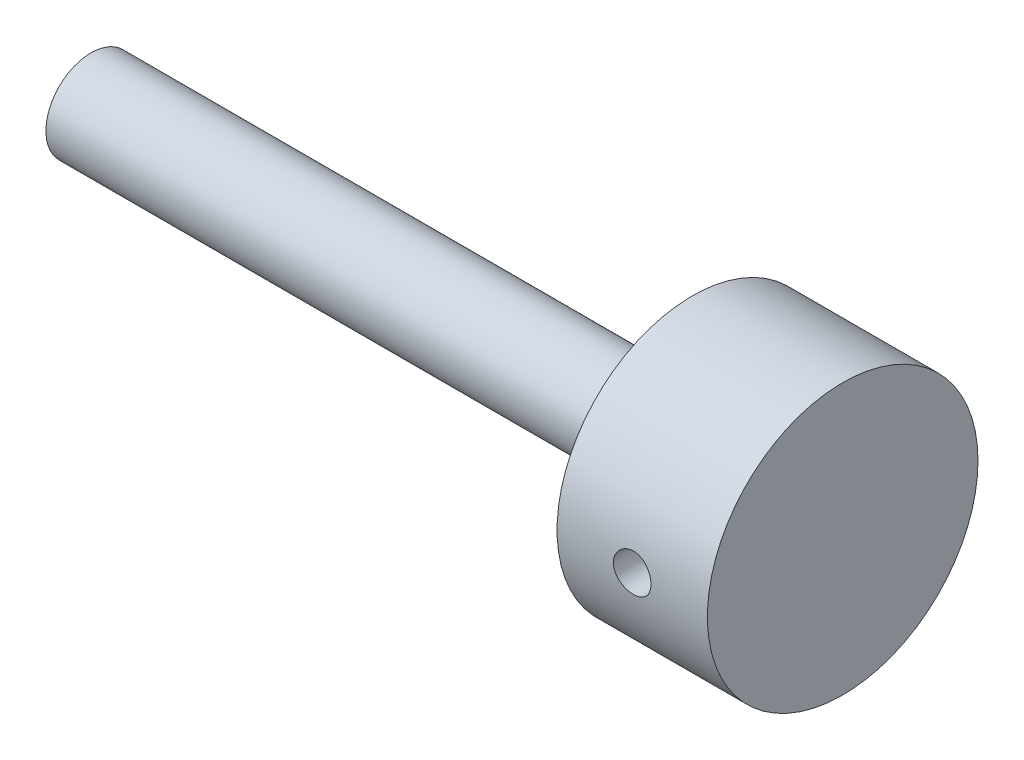
ISO-10303-21;
HEADER;
FILE_DESCRIPTION(('STEP AP214'),'2;1');
FILE_NAME('part.step','',(''),(''),'','','');
FILE_SCHEMA(('AUTOMOTIVE_DESIGN { 1 0 10303 214 1 1 1 1 }'));
ENDSEC;
DATA;
#1=APPLICATION_CONTEXT('core data for automotive mechanical design processes');
#2=APPLICATION_PROTOCOL_DEFINITION('international standard','automotive_design',2000,#1);
#3=PRODUCT_CONTEXT('',#1,'mechanical');
#4=PRODUCT('Part','Part','',(#3));
#5=PRODUCT_RELATED_PRODUCT_CATEGORY('part','',(#4));
#6=PRODUCT_DEFINITION_FORMATION('','',#4);
#7=PRODUCT_DEFINITION_CONTEXT('part definition',#1,'design');
#8=PRODUCT_DEFINITION('design','',#6,#7);
#9=PRODUCT_DEFINITION_SHAPE('','',#8);
#10=(LENGTH_UNIT() NAMED_UNIT(*) SI_UNIT(.MILLI.,.METRE.));
#11=(NAMED_UNIT(*) PLANE_ANGLE_UNIT() SI_UNIT($,.RADIAN.));
#12=(NAMED_UNIT(*) SI_UNIT($,.STERADIAN.) SOLID_ANGLE_UNIT());
#13=UNCERTAINTY_MEASURE_WITH_UNIT(LENGTH_MEASURE(1.E-05),#10,'distance_accuracy_value','');
#14=(GEOMETRIC_REPRESENTATION_CONTEXT(3) GLOBAL_UNCERTAINTY_ASSIGNED_CONTEXT((#13)) GLOBAL_UNIT_ASSIGNED_CONTEXT((#10,
#11,#12)) REPRESENTATION_CONTEXT('',''));
#15=CARTESIAN_POINT('',(0.,0.,0.));
#16=DIRECTION('',(0.,0.,1.));
#17=DIRECTION('',(1.,0.,0.));
#18=AXIS2_PLACEMENT_3D('',#15,#16,#17);
#19=CARTESIAN_POINT('',(-20.2352110000748,6.,0.));
#20=DIRECTION('',(1.,0.,0.));
#21=DIRECTION('',(0.,0.,-1.));
#22=AXIS2_PLACEMENT_3D('',#19,#20,#21);
#23=PLANE('',#22);
#24=CARTESIAN_POINT('',(-20.2352110000748,6.,0.));
#25=DIRECTION('',(1.,0.,0.));
#26=DIRECTION('',(0.,0.,-1.));
#27=AXIS2_PLACEMENT_3D('',#24,#25,#26);
#28=CIRCLE('',#27,6.);
#29=CARTESIAN_POINT('',(-20.2352110000748,6.,-6.));
#30=VERTEX_POINT('',#29);
#31=EDGE_CURVE('E10',#30,#30,#28,.T.);
#32=ORIENTED_EDGE('',*,*,#31,.F.);
#33=EDGE_LOOP('',(#32));
#34=FACE_BOUND('',#33,.T.);
#35=ADVANCED_FACE('F36',(#34),#23,.F.);
#36=CARTESIAN_POINT('',(79.7647889999252,6.,0.));
#37=DIRECTION('',(1.,0.,0.));
#38=DIRECTION('',(0.,0.,-1.));
#39=AXIS2_PLACEMENT_3D('',#36,#37,#38);
#40=CYLINDRICAL_SURFACE('',#39,6.);
#41=CARTESIAN_POINT('',(59.7647889999252,6.,0.));
#42=DIRECTION('',(1.,0.,0.));
#43=DIRECTION('',(0.,0.,-1.));
#44=AXIS2_PLACEMENT_3D('',#41,#42,#43);
#45=CIRCLE('',#44,6.);
#46=CARTESIAN_POINT('',(59.7647889999252,6.,-6.));
#47=VERTEX_POINT('',#46);
#48=EDGE_CURVE('E49',#47,#47,#45,.T.);
#49=ORIENTED_EDGE('',*,*,#48,.F.);
#50=EDGE_LOOP('',(#49));
#51=FACE_BOUND('',#50,.T.);
#52=ORIENTED_EDGE('',*,*,#31,.T.);
#53=EDGE_LOOP('',(#52));
#54=FACE_BOUND('',#53,.T.);
#55=ADVANCED_FACE('F84',(#51,#54),#40,.T.);
#56=CARTESIAN_POINT('',(59.7647889999252,0.,0.));
#57=DIRECTION('',(1.,0.,0.));
#58=DIRECTION('',(0.,0.,-1.));
#59=AXIS2_PLACEMENT_3D('',#56,#57,#58);
#60=PLANE('',#59);
#61=CARTESIAN_POINT('',(59.7647889999252,6.,0.));
#62=DIRECTION('',(1.,0.,0.));
#63=DIRECTION('',(0.,0.,-1.));
#64=AXIS2_PLACEMENT_3D('',#61,#62,#63);
#65=CIRCLE('',#64,18.);
#66=CARTESIAN_POINT('',(59.7647889999252,6.,-18.));
#67=VERTEX_POINT('',#66);
#68=EDGE_CURVE('E55',#67,#67,#65,.T.);
#69=ORIENTED_EDGE('',*,*,#68,.F.);
#70=EDGE_LOOP('',(#69));
#71=FACE_BOUND('',#70,.T.);
#72=ORIENTED_EDGE('',*,*,#48,.T.);
#73=EDGE_LOOP('',(#72));
#74=FACE_BOUND('',#73,.T.);
#75=ADVANCED_FACE('F80',(#71,#74),#60,.F.);
#76=CARTESIAN_POINT('',(79.7647889999252,6.,0.));
#77=DIRECTION('',(1.,0.,0.));
#78=DIRECTION('',(0.,0.,-1.));
#79=AXIS2_PLACEMENT_3D('',#76,#77,#78);
#80=CYLINDRICAL_SURFACE('',#79,18.);
#81=CARTESIAN_POINT('',(67.26,6.,-18.));
#82=CARTESIAN_POINT('',(67.2600058471731,5.86029511346504,-17.9999978822551));
#83=CARTESIAN_POINT('',(67.2717499855795,5.72050624717895,-17.998356438195));
#84=CARTESIAN_POINT('',(67.3184089818993,5.44482768012588,-17.991966325724));
#85=CARTESIAN_POINT('',(67.3533471632129,5.30894204800389,-17.9872145296815));
#86=CARTESIAN_POINT('',(67.4453370392228,5.04510012789121,-17.9751383249889));
#87=CARTESIAN_POINT('',(67.5023728689389,4.91713822733907,-17.9678157623709));
#88=CARTESIAN_POINT('',(67.6369020672775,4.67262362786672,-17.9514096201345));
#89=CARTESIAN_POINT('',(67.7143922847708,4.55606917534422,-17.9423263118276));
#90=CARTESIAN_POINT('',(67.8881877758561,4.33687084632937,-17.9233422162511));
#91=CARTESIAN_POINT('',(67.9846035392599,4.23431496241896,-17.9134368356955));
#92=CARTESIAN_POINT('',(68.1932756382988,4.04678353198305,-17.8939614447075));
#93=CARTESIAN_POINT('',(68.3055328344181,3.96180894106728,-17.8843914525283));
#94=CARTESIAN_POINT('',(68.5432837910686,3.81151627720471,-17.8666256039175));
#95=CARTESIAN_POINT('',(68.6688310852064,3.74628212845693,-17.8584356782365));
#96=CARTESIAN_POINT('',(68.9292324099031,3.63785824722693,-17.8444191089296));
#97=CARTESIAN_POINT('',(69.0640860054821,3.59466748521962,-17.8385923549355));
#98=CARTESIAN_POINT('',(69.3383517317424,3.53182706020549,-17.8300065030461));
#99=CARTESIAN_POINT('',(69.4777289288981,3.5120276433288,-17.8272278988528));
#100=CARTESIAN_POINT('',(69.7578531972749,3.49606826371923,-17.8249935406723));
#101=CARTESIAN_POINT('',(69.8986002005376,3.49990713415741,-17.8255376226713));
#102=CARTESIAN_POINT('',(70.1764175820531,3.53099272394062,-17.8298693151746));
#103=CARTESIAN_POINT('',(70.3135069363811,3.55807351338289,-17.8336339328517));
#104=CARTESIAN_POINT('',(70.5811766686316,3.63461486928016,-17.8439466331623));
#105=CARTESIAN_POINT('',(70.7117568865391,3.68407598561294,-17.850494784186));
#106=CARTESIAN_POINT('',(70.9632114573056,3.80414923438853,-17.8656624594304));
#107=CARTESIAN_POINT('',(71.0840514079048,3.8748324978801,-17.8742889301123));
#108=CARTESIAN_POINT('',(71.3122179232699,4.03529284208389,-17.8926360883656));
#109=CARTESIAN_POINT('',(71.4195437256254,4.12507099928037,-17.9023568376129));
#110=CARTESIAN_POINT('',(71.618597710814,4.32208756975106,-17.9218991641967));
#111=CARTESIAN_POINT('',(71.710184567337,4.42946881562134,-17.9317208925483));
#112=CARTESIAN_POINT('',(71.8740571548721,4.65815428166545,-17.9502810134803));
#113=CARTESIAN_POINT('',(71.9463428217097,4.77945854813001,-17.9590194024586));
#114=CARTESIAN_POINT('',(72.0695650175008,5.03266286653486,-17.9744355842438));
#115=CARTESIAN_POINT('',(72.1204916018471,5.16456782008334,-17.9811124168266));
#116=CARTESIAN_POINT('',(72.199432144166,5.43517076404883,-17.9916448860531));
#117=CARTESIAN_POINT('',(72.2274474283693,5.57386836077802,-17.995500685992));
#118=CARTESIAN_POINT('',(72.2595844142806,5.85289869852412,-17.9999352103298));
#119=CARTESIAN_POINT('',(72.2639005902507,5.99320863343554,-18.0005406065427));
#120=CARTESIAN_POINT('',(72.2490316469046,6.27255004510794,-17.9984784401596));
#121=CARTESIAN_POINT('',(72.2298471486667,6.41158155555743,-17.9958109640593));
#122=CARTESIAN_POINT('',(72.1686830887935,6.68383755861753,-17.9875193039057));
#123=CARTESIAN_POINT('',(72.1267973340586,6.81708352789336,-17.981907290394));
#124=CARTESIAN_POINT('',(72.0215180153155,7.07466091227819,-17.9683542243466));
#125=CARTESIAN_POINT('',(71.9581235687061,7.19899196131308,-17.9604130762376));
#126=CARTESIAN_POINT('',(71.8111635109732,7.43607162099956,-17.9430190816436));
#127=CARTESIAN_POINT('',(71.727473398468,7.54874236887612,-17.9335570310756));
#128=CARTESIAN_POINT('',(71.5424722960972,7.75850834553797,-17.9142056986001));
#129=CARTESIAN_POINT('',(71.4411604350254,7.85560280378663,-17.9043163955877));
#130=CARTESIAN_POINT('',(71.2229301065433,8.03215948608231,-17.8851416204648));
#131=CARTESIAN_POINT('',(71.1059062247135,8.11149200953695,-17.8758609190896));
#132=CARTESIAN_POINT('',(70.8600799629783,8.24937391017379,-17.8590358689341));
#133=CARTESIAN_POINT('',(70.7312778644475,8.3079237836781,-17.8514914786893));
#134=CARTESIAN_POINT('',(70.4659529084305,8.40237314291827,-17.8390269090509));
#135=CARTESIAN_POINT('',(70.3294555544005,8.43834314834653,-17.8340985669394));
#136=CARTESIAN_POINT('',(70.0522844684451,8.48683747101379,-17.8274016245777));
#137=CARTESIAN_POINT('',(69.9116109810431,8.49936315823789,-17.8256328396969));
#138=CARTESIAN_POINT('',(69.6313723770799,8.50058416164037,-17.8254614889764));
#139=CARTESIAN_POINT('',(69.4918081229882,8.48948331682615,-17.8270301293032));
#140=CARTESIAN_POINT('',(69.2165507831705,8.44420077670813,-17.8332946210443));
#141=CARTESIAN_POINT('',(69.0808576945688,8.4100190985501,-17.8379904701356));
#142=CARTESIAN_POINT('',(68.8172372556264,8.31961344674762,-17.849970749364));
#143=CARTESIAN_POINT('',(68.689305651727,8.2634016746902,-17.8572537463747));
#144=CARTESIAN_POINT('',(68.444656833081,8.13055155403106,-17.873589723246));
#145=CARTESIAN_POINT('',(68.3279398877599,8.05391271484812,-17.8826427456147));
#146=CARTESIAN_POINT('',(68.1079947434816,7.88163580114565,-17.901592023892));
#147=CARTESIAN_POINT('',(68.0048857284122,7.78584624785318,-17.911494618401));
#148=CARTESIAN_POINT('',(67.816130854171,7.57830619781846,-17.9309729070326));
#149=CARTESIAN_POINT('',(67.7304890840796,7.46655197413609,-17.940548524174));
#150=CARTESIAN_POINT('',(67.578747518909,7.22964388373001,-17.9583446077527));
#151=CARTESIAN_POINT('',(67.5127412990006,7.10442960684401,-17.9665585051));
#152=CARTESIAN_POINT('',(67.4027916497095,6.84464279822738,-17.9806405083311));
#153=CARTESIAN_POINT('',(67.3588248434355,6.71008035525225,-17.9865110983749));
#154=CARTESIAN_POINT('',(67.304434597614,6.47905802552182,-17.9938697142698));
#155=CARTESIAN_POINT('',(67.2877963720062,6.38403933635957,-17.9961570505205));
#156=CARTESIAN_POINT('',(67.2655771113275,6.19269374224067,-17.9992229163082));
#157=CARTESIAN_POINT('',(67.2599959666861,6.09636685025722,-18.0000014607965));
#158=CARTESIAN_POINT('',(67.26,6.,-18.));
#159=B_SPLINE_CURVE_WITH_KNOTS('',3,(#81,#82,#83,#84,#85,#86,#87,#88,#89,#90,#91,#92,#93,#94,
#95,#96,#97,#98,#99,#100,#101,#102,#103,#104,#105,#106,#107,#108,#109,#110,#111,#112,#113,#114,
#115,#116,#117,#118,#119,#120,#121,#122,#123,#124,#125,#126,#127,#128,#129,#130,#131,#132,#133,
#134,#135,#136,#137,#138,#139,#140,#141,#142,#143,#144,#145,#146,#147,#148,#149,#150,#151,#152,
#153,#154,#155,#156,#157,#158),.UNSPECIFIED.,.T.,.F.,(4,2,2,2,2,2,2,2,2,2,2,2,2,2,2,2,2,2,2,2,2,
2,2,2,2,2,2,2,2,2,2,2,2,2,2,2,2,2,4),(0.,0.418762590118354,0.837946917490899,1.25683084800829,
1.67565028440108,2.0969917504154,2.51835611191784,2.94148747056233,3.3645990652647,
3.78498691716355,4.20535401811856,4.62274474255583,5.04014572271217,5.45896164238596,
5.87780117927967,6.30022469829891,6.7226496218165,7.145271005038,7.56786792290228,
7.98699178008835,8.40610456086108,8.82349852913964,9.24090962709669,9.6609491043169,
10.0810093538825,10.504043572081,10.9270676868825,11.3487639852594,11.7704356407492,
12.1884840588101,12.606532166321,13.024349060198,13.442175989368,13.863448843644,
14.2848202049493,14.7081686164992,15.1310670332172,15.4199275929279,15.7087852901507),.UNSPECIFIED.);
#160=CARTESIAN_POINT('',(67.26,6.,-18.));
#161=VERTEX_POINT('',#160);
#162=EDGE_CURVE('E39',#161,#161,#159,.T.);
#163=ORIENTED_EDGE('',*,*,#162,.T.);
#164=EDGE_LOOP('',(#163));
#165=FACE_BOUND('',#164,.T.);
#166=CARTESIAN_POINT('',(72.26,6.,18.));
#167=CARTESIAN_POINT('',(72.2599941528269,5.86029511346504,17.9999978822551));
#168=CARTESIAN_POINT('',(72.2482500144205,5.72050624717895,17.998356438195));
#169=CARTESIAN_POINT('',(72.2015910181007,5.44482768012588,17.991966325724));
#170=CARTESIAN_POINT('',(72.1666528367871,5.30894204800389,17.9872145296815));
#171=CARTESIAN_POINT('',(72.0746629607772,5.04510012789121,17.9751383249889));
#172=CARTESIAN_POINT('',(72.0176271310611,4.91713822733907,17.9678157623709));
#173=CARTESIAN_POINT('',(71.8830979327225,4.67262362786672,17.9514096201345));
#174=CARTESIAN_POINT('',(71.8056077152292,4.55606917534422,17.9423263118276));
#175=CARTESIAN_POINT('',(71.6318122241439,4.33687084632937,17.9233422162511));
#176=CARTESIAN_POINT('',(71.5353964607401,4.23431496241896,17.9134368356955));
#177=CARTESIAN_POINT('',(71.3267243617012,4.04678353198305,17.8939614447075));
#178=CARTESIAN_POINT('',(71.2144671655819,3.96180894106728,17.8843914525283));
#179=CARTESIAN_POINT('',(70.9767162089313,3.8115162772047,17.8666256039175));
#180=CARTESIAN_POINT('',(70.8511689147936,3.74628212845691,17.8584356782365));
#181=CARTESIAN_POINT('',(70.5907675900968,3.63785824722692,17.8444191089296));
#182=CARTESIAN_POINT('',(70.4559139945179,3.59466748521962,17.8385923549355));
#183=CARTESIAN_POINT('',(70.1816482682576,3.53182706020548,17.8300065030461));
#184=CARTESIAN_POINT('',(70.0422710711019,3.5120276433288,17.8272278988528));
#185=CARTESIAN_POINT('',(69.7621468027251,3.49606826371923,17.8249935406723));
#186=CARTESIAN_POINT('',(69.6213997994624,3.49990713415741,17.8255376226713));
#187=CARTESIAN_POINT('',(69.3435824179469,3.53099272394062,17.8298693151746));
#188=CARTESIAN_POINT('',(69.2064930636189,3.55807351338289,17.8336339328517));
#189=CARTESIAN_POINT('',(68.9388233313684,3.63461486928017,17.8439466331623));
#190=CARTESIAN_POINT('',(68.8082431134609,3.68407598561294,17.850494784186));
#191=CARTESIAN_POINT('',(68.5567885426944,3.80414923438854,17.8656624594304));
#192=CARTESIAN_POINT('',(68.4359485920951,3.8748324978801,17.8742889301123));
#193=CARTESIAN_POINT('',(68.2077820767301,4.03529284208389,17.8926360883656));
#194=CARTESIAN_POINT('',(68.1004562743746,4.12507099928037,17.9023568376129));
#195=CARTESIAN_POINT('',(67.901402289186,4.32208756975106,17.9218991641967));
#196=CARTESIAN_POINT('',(67.809815432663,4.42946881562134,17.9317208925483));
#197=CARTESIAN_POINT('',(67.6459428451279,4.65815428166545,17.9502810134803));
#198=CARTESIAN_POINT('',(67.5736571782903,4.77945854813001,17.9590194024586));
#199=CARTESIAN_POINT('',(67.4504349824992,5.03266286653486,17.9744355842438));
#200=CARTESIAN_POINT('',(67.3995083981529,5.16456782008334,17.9811124168266));
#201=CARTESIAN_POINT('',(67.320567855834,5.43517076404883,17.9916448860531));
#202=CARTESIAN_POINT('',(67.2925525716308,5.57386836077802,17.995500685992));
#203=CARTESIAN_POINT('',(67.2604155857194,5.85289869852412,17.9999352103298));
#204=CARTESIAN_POINT('',(67.2560994097493,5.99320863343554,18.0005406065427));
#205=CARTESIAN_POINT('',(67.2709683530954,6.27255004510794,17.9984784401596));
#206=CARTESIAN_POINT('',(67.2901528513333,6.41158155555743,17.9958109640593));
#207=CARTESIAN_POINT('',(67.3513169112065,6.68383755861753,17.9875193039057));
#208=CARTESIAN_POINT('',(67.3932026659414,6.81708352789336,17.981907290394));
#209=CARTESIAN_POINT('',(67.4984819846845,7.07466091227819,17.9683542243466));
#210=CARTESIAN_POINT('',(67.5618764312939,7.19899196131308,17.9604130762376));
#211=CARTESIAN_POINT('',(67.7088364890268,7.43607162099956,17.9430190816436));
#212=CARTESIAN_POINT('',(67.792526601532,7.54874236887612,17.9335570310756));
#213=CARTESIAN_POINT('',(67.9775277039028,7.75850834553797,17.9142056986001));
#214=CARTESIAN_POINT('',(68.0788395649746,7.85560280378663,17.9043163955877));
#215=CARTESIAN_POINT('',(68.2970698934567,8.03215948608231,17.8851416204648));
#216=CARTESIAN_POINT('',(68.4140937752865,8.11149200953695,17.8758609190896));
#217=CARTESIAN_POINT('',(68.6599200370217,8.24937391017379,17.8590358689341));
#218=CARTESIAN_POINT('',(68.7887221355525,8.3079237836781,17.8514914786893));
#219=CARTESIAN_POINT('',(69.0540470915695,8.40237314291827,17.8390269090509));
#220=CARTESIAN_POINT('',(69.1905444455995,8.43834314834653,17.8340985669394));
#221=CARTESIAN_POINT('',(69.4677155315549,8.48683747101379,17.8274016245777));
#222=CARTESIAN_POINT('',(69.608389018957,8.49936315823789,17.8256328396969));
#223=CARTESIAN_POINT('',(69.8886276229201,8.50058416164037,17.8254614889764));
#224=CARTESIAN_POINT('',(70.0281918770118,8.48948331682615,17.8270301293032));
#225=CARTESIAN_POINT('',(70.3034492168295,8.44420077670813,17.8332946210443));
#226=CARTESIAN_POINT('',(70.4391423054312,8.4100190985501,17.8379904701356));
#227=CARTESIAN_POINT('',(70.7027627443736,8.31961344674762,17.849970749364));
#228=CARTESIAN_POINT('',(70.830694348273,8.2634016746902,17.8572537463747));
#229=CARTESIAN_POINT('',(71.075343166919,8.13055155403106,17.873589723246));
#230=CARTESIAN_POINT('',(71.1920601122401,8.05391271484812,17.8826427456147));
#231=CARTESIAN_POINT('',(71.4120052565184,7.88163580114564,17.901592023892));
#232=CARTESIAN_POINT('',(71.5151142715878,7.78584624785318,17.911494618401));
#233=CARTESIAN_POINT('',(71.703869145829,7.57830619781845,17.9309729070326));
#234=CARTESIAN_POINT('',(71.7895109159204,7.46655197413608,17.940548524174));
#235=CARTESIAN_POINT('',(71.9412524810911,7.22964388373,17.9583446077527));
#236=CARTESIAN_POINT('',(72.0072587009994,7.104429606844,17.9665585051));
#237=CARTESIAN_POINT('',(72.1172083502905,6.84464279822737,17.9806405083311));
#238=CARTESIAN_POINT('',(72.1611751565645,6.71008035525224,17.9865110983749));
#239=CARTESIAN_POINT('',(72.215565402386,6.47905802552182,17.9938697142698));
#240=CARTESIAN_POINT('',(72.2322036279938,6.38403933635957,17.9961570505205));
#241=CARTESIAN_POINT('',(72.2544228886725,6.19269374224067,17.9992229163082));
#242=CARTESIAN_POINT('',(72.2600040333139,6.09636685025722,18.0000014607965));
#243=CARTESIAN_POINT('',(72.26,6.,18.));
#244=B_SPLINE_CURVE_WITH_KNOTS('',3,(#166,#167,#168,#169,#170,#171,#172,#173,#174,#175,#176,
#177,#178,#179,#180,#181,#182,#183,#184,#185,#186,#187,#188,#189,#190,#191,#192,#193,#194,#195,
#196,#197,#198,#199,#200,#201,#202,#203,#204,#205,#206,#207,#208,#209,#210,#211,#212,#213,#214,
#215,#216,#217,#218,#219,#220,#221,#222,#223,#224,#225,#226,#227,#228,#229,#230,#231,#232,#233,
#234,#235,#236,#237,#238,#239,#240,#241,#242,#243),.UNSPECIFIED.,.T.,.F.,(4,2,2,2,2,2,2,2,2,2,2,
2,2,2,2,2,2,2,2,2,2,2,2,2,2,2,2,2,2,2,2,2,2,2,2,2,2,2,4),(0.,0.418762590118354,
0.837946917490899,1.25683084800829,1.67565028440108,2.0969917504154,2.51835611191784,
2.94148747056238,3.3645990652647,3.78498691716358,4.20535401811856,4.62274474255586,
5.04014572271217,5.45896164238598,5.87780117927968,6.30022469829892,6.7226496218165,
7.145271005038,7.56786792290228,7.98699178008835,8.40610456086109,8.82349852913964,
9.24090962709669,9.6609491043169,10.0810093538825,10.504043572081,10.9270676868825,
11.3487639852594,11.7704356407492,12.1884840588101,12.606532166321,13.024349060198,
13.442175989368,13.863448843644,14.2848202049493,14.7081686164993,15.1310670332172,
15.4199275929279,15.7087852901507),.UNSPECIFIED.);
#245=CARTESIAN_POINT('',(72.26,6.,18.));
#246=VERTEX_POINT('',#245);
#247=EDGE_CURVE('E58',#246,#246,#244,.T.);
#248=ORIENTED_EDGE('',*,*,#247,.T.);
#249=EDGE_LOOP('',(#248));
#250=FACE_BOUND('',#249,.T.);
#251=CARTESIAN_POINT('',(79.7647889999252,6.,0.));
#252=DIRECTION('',(1.,0.,0.));
#253=DIRECTION('',(0.,0.,-1.));
#254=AXIS2_PLACEMENT_3D('',#251,#252,#253);
#255=CIRCLE('',#254,18.);
#256=CARTESIAN_POINT('',(79.7647889999252,6.,-18.));
#257=VERTEX_POINT('',#256);
#258=EDGE_CURVE('E102',#257,#257,#255,.T.);
#259=ORIENTED_EDGE('',*,*,#258,.F.);
#260=EDGE_LOOP('',(#259));
#261=FACE_BOUND('',#260,.T.);
#262=ORIENTED_EDGE('',*,*,#68,.T.);
#263=EDGE_LOOP('',(#262));
#264=FACE_BOUND('',#263,.T.);
#265=ADVANCED_FACE('F64',(#165,#250,#261,#264),#80,.T.);
#266=CARTESIAN_POINT('',(79.7647889999252,0.24146410446101,0.));
#267=DIRECTION('',(-1.,0.,0.));
#268=DIRECTION('',(0.,0.,1.));
#269=AXIS2_PLACEMENT_3D('',#266,#267,#268);
#270=PLANE('',#269);
#271=ORIENTED_EDGE('',*,*,#258,.T.);
#272=EDGE_LOOP('',(#271));
#273=FACE_BOUND('',#272,.T.);
#274=ADVANCED_FACE('F71',(#273),#270,.F.);
#275=CARTESIAN_POINT('',(69.76,6.,-52.5));
#276=DIRECTION('',(0.,0.,1.));
#277=DIRECTION('',(1.,0.,0.));
#278=AXIS2_PLACEMENT_3D('',#275,#276,#277);
#279=CYLINDRICAL_SURFACE('',#278,2.50000000000001);
#280=ORIENTED_EDGE('',*,*,#247,.F.);
#281=EDGE_LOOP('',(#280));
#282=FACE_BOUND('',#281,.T.);
#283=ORIENTED_EDGE('',*,*,#162,.F.);
#284=EDGE_LOOP('',(#283));
#285=FACE_BOUND('',#284,.T.);
#286=ADVANCED_FACE('F68',(#282,#285),#279,.F.);
#287=CLOSED_SHELL('',(#35,#55,#75,#265,#274,#286));
#288=MANIFOLD_SOLID_BREP('B2',#287);
#289=ADVANCED_BREP_SHAPE_REPRESENTATION('',(#18,#288),#14);
#290=SHAPE_DEFINITION_REPRESENTATION(#9,#289);
ENDSEC;
END-ISO-10303-21;
